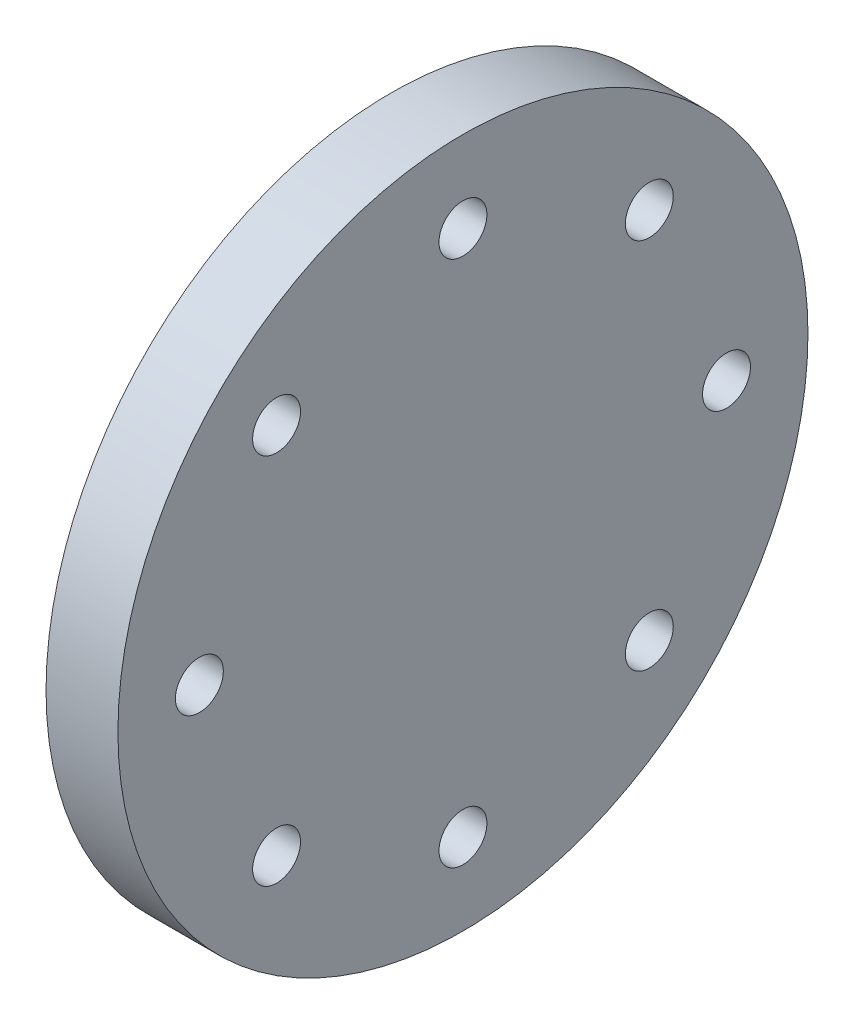
ISO-10303-21;
HEADER;
FILE_DESCRIPTION(('STEP AP214'),'2;1');
FILE_NAME('part.step','',(''),(''),'','','');
FILE_SCHEMA(('AUTOMOTIVE_DESIGN { 1 0 10303 214 1 1 1 1 }'));
ENDSEC;
DATA;
#1=APPLICATION_CONTEXT('core data for automotive mechanical design processes');
#2=APPLICATION_PROTOCOL_DEFINITION('international standard','automotive_design',2000,#1);
#3=PRODUCT_CONTEXT('',#1,'mechanical');
#4=PRODUCT('Part','Part','',(#3));
#5=PRODUCT_RELATED_PRODUCT_CATEGORY('part','',(#4));
#6=PRODUCT_DEFINITION_FORMATION('','',#4);
#7=PRODUCT_DEFINITION_CONTEXT('part definition',#1,'design');
#8=PRODUCT_DEFINITION('design','',#6,#7);
#9=PRODUCT_DEFINITION_SHAPE('','',#8);
#10=(LENGTH_UNIT() NAMED_UNIT(*) SI_UNIT(.MILLI.,.METRE.));
#11=(NAMED_UNIT(*) PLANE_ANGLE_UNIT() SI_UNIT($,.RADIAN.));
#12=(NAMED_UNIT(*) SI_UNIT($,.STERADIAN.) SOLID_ANGLE_UNIT());
#13=UNCERTAINTY_MEASURE_WITH_UNIT(LENGTH_MEASURE(1.E-05),#10,'distance_accuracy_value','');
#14=(GEOMETRIC_REPRESENTATION_CONTEXT(3) GLOBAL_UNCERTAINTY_ASSIGNED_CONTEXT((#13)) GLOBAL_UNIT_ASSIGNED_CONTEXT((#10,
#11,#12)) REPRESENTATION_CONTEXT('',''));
#15=CARTESIAN_POINT('',(0.,0.,0.));
#16=DIRECTION('',(0.,0.,1.));
#17=DIRECTION('',(1.,0.,0.));
#18=AXIS2_PLACEMENT_3D('',#15,#16,#17);
#19=CARTESIAN_POINT('',(15.,0.,0.));
#20=DIRECTION('',(1.,0.,0.));
#21=DIRECTION('',(0.,0.,-1.));
#22=AXIS2_PLACEMENT_3D('',#19,#20,#21);
#23=PLANE('',#22);
#24=CARTESIAN_POINT('',(15.,-2.34142324931068E-12,54.9999999999977));
#25=DIRECTION('',(1.,0.,0.));
#26=DIRECTION('',(0.,0.,-1.));
#27=AXIS2_PLACEMENT_3D('',#24,#25,#26);
#28=CIRCLE('',#27,5.00000000000347);
#29=CARTESIAN_POINT('',(15.,-2.34142324931068E-12,49.9999999999942));
#30=VERTEX_POINT('',#29);
#31=EDGE_CURVE('E76',#30,#30,#28,.T.);
#32=ORIENTED_EDGE('',*,*,#31,.F.);
#33=EDGE_LOOP('',(#32));
#34=FACE_BOUND('',#33,.T.);
#35=CARTESIAN_POINT('',(15.,-55.,-4.66937538383073E-12));
#36=DIRECTION('',(1.,0.,0.));
#37=DIRECTION('',(0.,0.,-1.));
#38=AXIS2_PLACEMENT_3D('',#35,#36,#37);
#39=CIRCLE('',#38,5.00000000000483);
#40=CARTESIAN_POINT('',(15.,-55.,-5.0000000000095));
#41=VERTEX_POINT('',#40);
#42=EDGE_CURVE('E64',#41,#41,#39,.T.);
#43=ORIENTED_EDGE('',*,*,#42,.F.);
#44=EDGE_LOOP('',(#43));
#45=FACE_BOUND('',#44,.T.);
#46=CARTESIAN_POINT('',(15.,2.33468769191537E-12,-55.0000000000023));
#47=DIRECTION('',(1.,0.,0.));
#48=DIRECTION('',(0.,0.,-1.));
#49=AXIS2_PLACEMENT_3D('',#46,#47,#48);
#50=CIRCLE('',#49,5.00000000000173);
#51=CARTESIAN_POINT('',(15.,2.33468769191537E-12,-60.0000000000041));
#52=VERTEX_POINT('',#51);
#53=EDGE_CURVE('E52',#52,#52,#50,.T.);
#54=ORIENTED_EDGE('',*,*,#53,.F.);
#55=EDGE_LOOP('',(#54));
#56=FACE_BOUND('',#55,.T.);
#57=CARTESIAN_POINT('',(15.,55.,0.));
#58=DIRECTION('',(1.,0.,0.));
#59=DIRECTION('',(0.,0.,-1.));
#60=AXIS2_PLACEMENT_3D('',#57,#58,#59);
#61=CIRCLE('',#60,5.);
#62=CARTESIAN_POINT('',(15.,55.,-5.));
#63=VERTEX_POINT('',#62);
#64=EDGE_CURVE('E41',#63,#63,#61,.T.);
#65=ORIENTED_EDGE('',*,*,#64,.F.);
#66=EDGE_LOOP('',(#65));
#67=FACE_BOUND('',#66,.T.);
#68=CARTESIAN_POINT('',(15.,0.,0.));
#69=DIRECTION('',(1.,0.,0.));
#70=DIRECTION('',(0.,0.,-1.));
#71=AXIS2_PLACEMENT_3D('',#68,#69,#70);
#72=CIRCLE('',#71,72.);
#73=CARTESIAN_POINT('',(15.,0.,-72.));
#74=VERTEX_POINT('',#73);
#75=EDGE_CURVE('E10',#74,#74,#72,.T.);
#76=ORIENTED_EDGE('',*,*,#75,.T.);
#77=EDGE_LOOP('',(#76));
#78=FACE_BOUND('',#77,.T.);
#79=CARTESIAN_POINT('',(15.,38.8908729652618,-38.8908729652608));
#80=DIRECTION('',(1.,0.,0.));
#81=DIRECTION('',(0.,0.,-1.));
#82=AXIS2_PLACEMENT_3D('',#79,#80,#81);
#83=CIRCLE('',#82,5.00000000000027);
#84=CARTESIAN_POINT('',(15.,38.8908729652618,-43.8908729652611));
#85=VERTEX_POINT('',#84);
#86=EDGE_CURVE('E46',#85,#85,#83,.T.);
#87=ORIENTED_EDGE('',*,*,#86,.F.);
#88=EDGE_LOOP('',(#87));
#89=FACE_BOUND('',#88,.T.);
#90=CARTESIAN_POINT('',(15.,-38.8908729652585,-38.8908729652641));
#91=DIRECTION('',(1.,0.,0.));
#92=DIRECTION('',(0.,0.,-1.));
#93=AXIS2_PLACEMENT_3D('',#90,#91,#92);
#94=CIRCLE('',#93,5.0000000000036);
#95=CARTESIAN_POINT('',(15.,-38.8908729652585,-43.8908729652677));
#96=VERTEX_POINT('',#95);
#97=EDGE_CURVE('E58',#96,#96,#94,.T.);
#98=ORIENTED_EDGE('',*,*,#97,.F.);
#99=EDGE_LOOP('',(#98));
#100=FACE_BOUND('',#99,.T.);
#101=CARTESIAN_POINT('',(15.,-38.8908729652618,38.8908729652561));
#102=DIRECTION('',(1.,0.,0.));
#103=DIRECTION('',(0.,0.,-1.));
#104=AXIS2_PLACEMENT_3D('',#101,#102,#103);
#105=CIRCLE('',#104,5.00000000000476);
#106=CARTESIAN_POINT('',(15.,-38.8908729652618,33.8908729652514));
#107=VERTEX_POINT('',#106);
#108=EDGE_CURVE('E70',#107,#107,#105,.T.);
#109=ORIENTED_EDGE('',*,*,#108,.F.);
#110=EDGE_LOOP('',(#109));
#111=FACE_BOUND('',#110,.T.);
#112=CARTESIAN_POINT('',(15.,38.8908729652585,38.8908729652594));
#113=DIRECTION('',(1.,0.,0.));
#114=DIRECTION('',(0.,0.,-1.));
#115=AXIS2_PLACEMENT_3D('',#112,#113,#114);
#116=CIRCLE('',#115,5.00000000000179);
#117=CARTESIAN_POINT('',(15.,38.8908729652585,33.8908729652577));
#118=VERTEX_POINT('',#117);
#119=EDGE_CURVE('E82',#118,#118,#116,.T.);
#120=ORIENTED_EDGE('',*,*,#119,.F.);
#121=EDGE_LOOP('',(#120));
#122=FACE_BOUND('',#121,.T.);
#123=ADVANCED_FACE('F30',(#34,#45,#56,#67,#78,#89,#100,#111,#122),#23,.T.);
#124=CARTESIAN_POINT('',(0.,0.,0.));
#125=DIRECTION('',(1.,0.,0.));
#126=DIRECTION('',(0.,0.,-1.));
#127=AXIS2_PLACEMENT_3D('',#124,#125,#126);
#128=PLANE('',#127);
#129=CARTESIAN_POINT('',(0.,0.,0.));
#130=DIRECTION('',(1.,0.,0.));
#131=DIRECTION('',(0.,0.,-1.));
#132=AXIS2_PLACEMENT_3D('',#129,#130,#131);
#133=CIRCLE('',#132,72.);
#134=CARTESIAN_POINT('',(0.,0.,-72.));
#135=VERTEX_POINT('',#134);
#136=EDGE_CURVE('E34',#135,#135,#133,.T.);
#137=ORIENTED_EDGE('',*,*,#136,.F.);
#138=EDGE_LOOP('',(#137));
#139=FACE_BOUND('',#138,.T.);
#140=CARTESIAN_POINT('',(0.,55.,0.));
#141=DIRECTION('',(1.,0.,0.));
#142=DIRECTION('',(0.,0.,-1.));
#143=AXIS2_PLACEMENT_3D('',#140,#141,#142);
#144=CIRCLE('',#143,5.);
#145=CARTESIAN_POINT('',(0.,55.,-5.));
#146=VERTEX_POINT('',#145);
#147=EDGE_CURVE('E43',#146,#146,#144,.T.);
#148=ORIENTED_EDGE('',*,*,#147,.T.);
#149=EDGE_LOOP('',(#148));
#150=FACE_BOUND('',#149,.T.);
#151=CARTESIAN_POINT('',(0.,38.8908729652618,-38.8908729652608));
#152=DIRECTION('',(1.,0.,0.));
#153=DIRECTION('',(0.,0.,-1.));
#154=AXIS2_PLACEMENT_3D('',#151,#152,#153);
#155=CIRCLE('',#154,5.00000000000027);
#156=CARTESIAN_POINT('',(0.,38.8908729652618,-43.8908729652611));
#157=VERTEX_POINT('',#156);
#158=EDGE_CURVE('E49',#157,#157,#155,.T.);
#159=ORIENTED_EDGE('',*,*,#158,.T.);
#160=EDGE_LOOP('',(#159));
#161=FACE_BOUND('',#160,.T.);
#162=CARTESIAN_POINT('',(0.,2.33468769191537E-12,-55.0000000000023));
#163=DIRECTION('',(1.,0.,0.));
#164=DIRECTION('',(0.,0.,-1.));
#165=AXIS2_PLACEMENT_3D('',#162,#163,#164);
#166=CIRCLE('',#165,5.00000000000173);
#167=CARTESIAN_POINT('',(0.,2.33468769191537E-12,-60.0000000000041));
#168=VERTEX_POINT('',#167);
#169=EDGE_CURVE('E55',#168,#168,#166,.T.);
#170=ORIENTED_EDGE('',*,*,#169,.T.);
#171=EDGE_LOOP('',(#170));
#172=FACE_BOUND('',#171,.T.);
#173=CARTESIAN_POINT('',(0.,-38.8908729652585,-38.8908729652641));
#174=DIRECTION('',(1.,0.,0.));
#175=DIRECTION('',(0.,0.,-1.));
#176=AXIS2_PLACEMENT_3D('',#173,#174,#175);
#177=CIRCLE('',#176,5.0000000000036);
#178=CARTESIAN_POINT('',(0.,-38.8908729652585,-43.8908729652677));
#179=VERTEX_POINT('',#178);
#180=EDGE_CURVE('E61',#179,#179,#177,.T.);
#181=ORIENTED_EDGE('',*,*,#180,.T.);
#182=EDGE_LOOP('',(#181));
#183=FACE_BOUND('',#182,.T.);
#184=CARTESIAN_POINT('',(0.,-55.,-4.66937538383073E-12));
#185=DIRECTION('',(1.,0.,0.));
#186=DIRECTION('',(0.,0.,-1.));
#187=AXIS2_PLACEMENT_3D('',#184,#185,#186);
#188=CIRCLE('',#187,5.00000000000483);
#189=CARTESIAN_POINT('',(0.,-55.,-5.0000000000095));
#190=VERTEX_POINT('',#189);
#191=EDGE_CURVE('E67',#190,#190,#188,.T.);
#192=ORIENTED_EDGE('',*,*,#191,.T.);
#193=EDGE_LOOP('',(#192));
#194=FACE_BOUND('',#193,.T.);
#195=CARTESIAN_POINT('',(0.,-38.8908729652618,38.8908729652561));
#196=DIRECTION('',(1.,0.,0.));
#197=DIRECTION('',(0.,0.,-1.));
#198=AXIS2_PLACEMENT_3D('',#195,#196,#197);
#199=CIRCLE('',#198,5.00000000000476);
#200=CARTESIAN_POINT('',(0.,-38.8908729652618,33.8908729652514));
#201=VERTEX_POINT('',#200);
#202=EDGE_CURVE('E73',#201,#201,#199,.T.);
#203=ORIENTED_EDGE('',*,*,#202,.T.);
#204=EDGE_LOOP('',(#203));
#205=FACE_BOUND('',#204,.T.);
#206=CARTESIAN_POINT('',(0.,-2.34142324931068E-12,54.9999999999977));
#207=DIRECTION('',(1.,0.,0.));
#208=DIRECTION('',(0.,0.,-1.));
#209=AXIS2_PLACEMENT_3D('',#206,#207,#208);
#210=CIRCLE('',#209,5.00000000000347);
#211=CARTESIAN_POINT('',(0.,-2.34142324931068E-12,49.9999999999942));
#212=VERTEX_POINT('',#211);
#213=EDGE_CURVE('E79',#212,#212,#210,.T.);
#214=ORIENTED_EDGE('',*,*,#213,.T.);
#215=EDGE_LOOP('',(#214));
#216=FACE_BOUND('',#215,.T.);
#217=CARTESIAN_POINT('',(0.,38.8908729652585,38.8908729652594));
#218=DIRECTION('',(1.,0.,0.));
#219=DIRECTION('',(0.,0.,-1.));
#220=AXIS2_PLACEMENT_3D('',#217,#218,#219);
#221=CIRCLE('',#220,5.00000000000179);
#222=CARTESIAN_POINT('',(0.,38.8908729652585,33.8908729652577));
#223=VERTEX_POINT('',#222);
#224=EDGE_CURVE('E85',#223,#223,#221,.T.);
#225=ORIENTED_EDGE('',*,*,#224,.T.);
#226=EDGE_LOOP('',(#225));
#227=FACE_BOUND('',#226,.T.);
#228=ADVANCED_FACE('F95',(#139,#150,#161,#172,#183,#194,#205,#216,#227),#128,.F.);
#229=CARTESIAN_POINT('',(15.,0.,0.));
#230=DIRECTION('',(-1.,0.,0.));
#231=DIRECTION('',(0.,0.,1.));
#232=AXIS2_PLACEMENT_3D('',#229,#230,#231);
#233=CYLINDRICAL_SURFACE('',#232,72.);
#234=ORIENTED_EDGE('',*,*,#75,.F.);
#235=EDGE_LOOP('',(#234));
#236=FACE_BOUND('',#235,.T.);
#237=ORIENTED_EDGE('',*,*,#136,.T.);
#238=EDGE_LOOP('',(#237));
#239=FACE_BOUND('',#238,.T.);
#240=ADVANCED_FACE('F32',(#236,#239),#233,.T.);
#241=CARTESIAN_POINT('',(15.,55.,0.));
#242=DIRECTION('',(-1.,0.,0.));
#243=DIRECTION('',(0.,0.,1.));
#244=AXIS2_PLACEMENT_3D('',#241,#242,#243);
#245=CYLINDRICAL_SURFACE('',#244,5.);
#246=ORIENTED_EDGE('',*,*,#64,.T.);
#247=EDGE_LOOP('',(#246));
#248=FACE_BOUND('',#247,.T.);
#249=ORIENTED_EDGE('',*,*,#147,.F.);
#250=EDGE_LOOP('',(#249));
#251=FACE_BOUND('',#250,.T.);
#252=ADVANCED_FACE('F105',(#248,#251),#245,.F.);
#253=CARTESIAN_POINT('',(15.,38.8908729652618,-38.8908729652608));
#254=DIRECTION('',(-1.,0.,0.));
#255=DIRECTION('',(0.,0.,1.));
#256=AXIS2_PLACEMENT_3D('',#253,#254,#255);
#257=CYLINDRICAL_SURFACE('',#256,5.00000000000027);
#258=ORIENTED_EDGE('',*,*,#86,.T.);
#259=EDGE_LOOP('',(#258));
#260=FACE_BOUND('',#259,.T.);
#261=ORIENTED_EDGE('',*,*,#158,.F.);
#262=EDGE_LOOP('',(#261));
#263=FACE_BOUND('',#262,.T.);
#264=ADVANCED_FACE('F108',(#260,#263),#257,.F.);
#265=CARTESIAN_POINT('',(15.,2.33468769191537E-12,-55.0000000000023));
#266=DIRECTION('',(-1.,0.,0.));
#267=DIRECTION('',(0.,0.,1.));
#268=AXIS2_PLACEMENT_3D('',#265,#266,#267);
#269=CYLINDRICAL_SURFACE('',#268,5.00000000000173);
#270=ORIENTED_EDGE('',*,*,#53,.T.);
#271=EDGE_LOOP('',(#270));
#272=FACE_BOUND('',#271,.T.);
#273=ORIENTED_EDGE('',*,*,#169,.F.);
#274=EDGE_LOOP('',(#273));
#275=FACE_BOUND('',#274,.T.);
#276=ADVANCED_FACE('F112',(#272,#275),#269,.F.);
#277=CARTESIAN_POINT('',(15.,-38.8908729652585,-38.8908729652641));
#278=DIRECTION('',(-1.,0.,0.));
#279=DIRECTION('',(0.,0.,1.));
#280=AXIS2_PLACEMENT_3D('',#277,#278,#279);
#281=CYLINDRICAL_SURFACE('',#280,5.0000000000036);
#282=ORIENTED_EDGE('',*,*,#97,.T.);
#283=EDGE_LOOP('',(#282));
#284=FACE_BOUND('',#283,.T.);
#285=ORIENTED_EDGE('',*,*,#180,.F.);
#286=EDGE_LOOP('',(#285));
#287=FACE_BOUND('',#286,.T.);
#288=ADVANCED_FACE('F116',(#284,#287),#281,.F.);
#289=CARTESIAN_POINT('',(15.,-55.,-4.66937538383073E-12));
#290=DIRECTION('',(-1.,0.,0.));
#291=DIRECTION('',(0.,0.,1.));
#292=AXIS2_PLACEMENT_3D('',#289,#290,#291);
#293=CYLINDRICAL_SURFACE('',#292,5.00000000000483);
#294=ORIENTED_EDGE('',*,*,#42,.T.);
#295=EDGE_LOOP('',(#294));
#296=FACE_BOUND('',#295,.T.);
#297=ORIENTED_EDGE('',*,*,#191,.F.);
#298=EDGE_LOOP('',(#297));
#299=FACE_BOUND('',#298,.T.);
#300=ADVANCED_FACE('F120',(#296,#299),#293,.F.);
#301=CARTESIAN_POINT('',(15.,-38.8908729652618,38.8908729652561));
#302=DIRECTION('',(-1.,0.,0.));
#303=DIRECTION('',(0.,0.,1.));
#304=AXIS2_PLACEMENT_3D('',#301,#302,#303);
#305=CYLINDRICAL_SURFACE('',#304,5.00000000000476);
#306=ORIENTED_EDGE('',*,*,#108,.T.);
#307=EDGE_LOOP('',(#306));
#308=FACE_BOUND('',#307,.T.);
#309=ORIENTED_EDGE('',*,*,#202,.F.);
#310=EDGE_LOOP('',(#309));
#311=FACE_BOUND('',#310,.T.);
#312=ADVANCED_FACE('F124',(#308,#311),#305,.F.);
#313=CARTESIAN_POINT('',(15.,-2.34142324931068E-12,54.9999999999977));
#314=DIRECTION('',(-1.,0.,0.));
#315=DIRECTION('',(0.,0.,1.));
#316=AXIS2_PLACEMENT_3D('',#313,#314,#315);
#317=CYLINDRICAL_SURFACE('',#316,5.00000000000347);
#318=ORIENTED_EDGE('',*,*,#31,.T.);
#319=EDGE_LOOP('',(#318));
#320=FACE_BOUND('',#319,.T.);
#321=ORIENTED_EDGE('',*,*,#213,.F.);
#322=EDGE_LOOP('',(#321));
#323=FACE_BOUND('',#322,.T.);
#324=ADVANCED_FACE('F128',(#320,#323),#317,.F.);
#325=CARTESIAN_POINT('',(15.,38.8908729652585,38.8908729652594));
#326=DIRECTION('',(-1.,0.,0.));
#327=DIRECTION('',(0.,0.,1.));
#328=AXIS2_PLACEMENT_3D('',#325,#326,#327);
#329=CYLINDRICAL_SURFACE('',#328,5.00000000000179);
#330=ORIENTED_EDGE('',*,*,#119,.T.);
#331=EDGE_LOOP('',(#330));
#332=FACE_BOUND('',#331,.T.);
#333=ORIENTED_EDGE('',*,*,#224,.F.);
#334=EDGE_LOOP('',(#333));
#335=FACE_BOUND('',#334,.T.);
#336=ADVANCED_FACE('F91',(#332,#335),#329,.F.);
#337=CLOSED_SHELL('',(#123,#228,#240,#252,#264,#276,#288,#300,#312,#324,#336));
#338=MANIFOLD_SOLID_BREP('B2',#337);
#339=ADVANCED_BREP_SHAPE_REPRESENTATION('',(#18,#338),#14);
#340=SHAPE_DEFINITION_REPRESENTATION(#9,#339);
ENDSEC;
END-ISO-10303-21;
